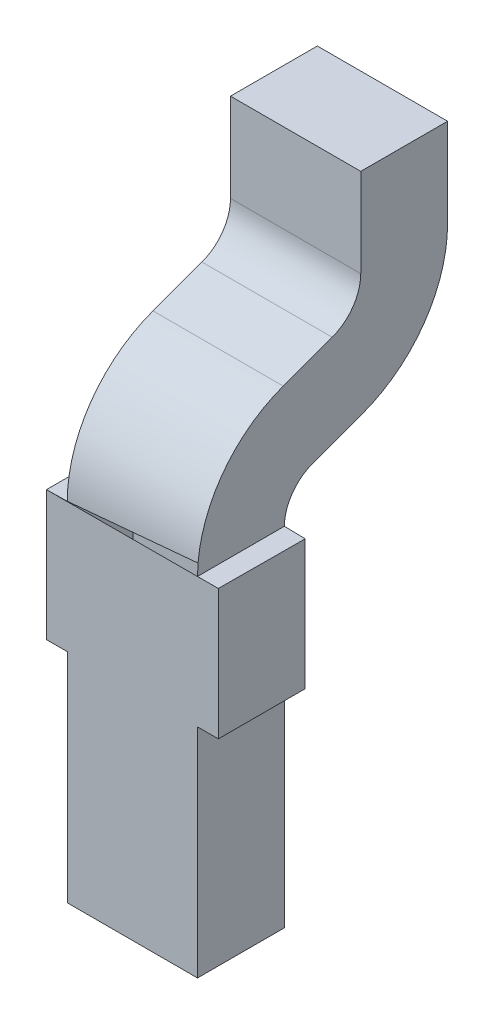
ISO-10303-21;
HEADER;
FILE_DESCRIPTION(('STEP AP214'),'2;1');
FILE_NAME('part.step','',(''),(''),'','','');
FILE_SCHEMA(('AUTOMOTIVE_DESIGN { 1 0 10303 214 1 1 1 1 }'));
ENDSEC;
DATA;
#1=APPLICATION_CONTEXT('core data for automotive mechanical design processes');
#2=APPLICATION_PROTOCOL_DEFINITION('international standard','automotive_design',2000,#1);
#3=PRODUCT_CONTEXT('',#1,'mechanical');
#4=PRODUCT('Part','Part','',(#3));
#5=PRODUCT_RELATED_PRODUCT_CATEGORY('part','',(#4));
#6=PRODUCT_DEFINITION_FORMATION('','',#4);
#7=PRODUCT_DEFINITION_CONTEXT('part definition',#1,'design');
#8=PRODUCT_DEFINITION('design','',#6,#7);
#9=PRODUCT_DEFINITION_SHAPE('','',#8);
#10=(LENGTH_UNIT() NAMED_UNIT(*) SI_UNIT(.MILLI.,.METRE.));
#11=(NAMED_UNIT(*) PLANE_ANGLE_UNIT() SI_UNIT($,.RADIAN.));
#12=(NAMED_UNIT(*) SI_UNIT($,.STERADIAN.) SOLID_ANGLE_UNIT());
#13=UNCERTAINTY_MEASURE_WITH_UNIT(LENGTH_MEASURE(1.E-05),#10,'distance_accuracy_value','');
#14=(GEOMETRIC_REPRESENTATION_CONTEXT(3) GLOBAL_UNCERTAINTY_ASSIGNED_CONTEXT((#13)) GLOBAL_UNIT_ASSIGNED_CONTEXT((#10,
#11,#12)) REPRESENTATION_CONTEXT('',''));
#15=CARTESIAN_POINT('',(0.,0.,0.));
#16=DIRECTION('',(0.,0.,1.));
#17=DIRECTION('',(1.,0.,0.));
#18=AXIS2_PLACEMENT_3D('',#15,#16,#17);
#19=CARTESIAN_POINT('',(135.749744279938,101.758469982888,143.086328634145));
#20=DIRECTION('',(1.,0.,0.));
#21=DIRECTION('',(0.,1.,0.));
#22=AXIS2_PLACEMENT_3D('',#19,#20,#21);
#23=PLANE('',#22);
#24=DIRECTION('',(0.,1.,0.));
#25=VECTOR('',#24,1.);
#26=CARTESIAN_POINT('',(135.749744279938,99.9047446285661,143.151470551509));
#27=LINE('',#26,#25);
#28=CARTESIAN_POINT('',(135.749744279938,99.9047446285661,143.151470551509));
#29=VERTEX_POINT('',#28);
#30=CARTESIAN_POINT('',(135.749744279938,101.15704329235,143.151470551509));
#31=VERTEX_POINT('',#30);
#32=EDGE_CURVE('E67',#29,#31,#27,.T.);
#33=ORIENTED_EDGE('',*,*,#32,.F.);
#34=DIRECTION('',(0.,0.,-1.));
#35=VECTOR('',#34,1.);
#36=CARTESIAN_POINT('',(135.749744279938,99.9047446285661,143.651470551509));
#37=LINE('',#36,#35);
#38=CARTESIAN_POINT('',(135.749744279938,99.9047446285661,143.651470551509));
#39=VERTEX_POINT('',#38);
#40=EDGE_CURVE('E233',#39,#29,#37,.T.);
#41=ORIENTED_EDGE('',*,*,#40,.F.);
#42=DIRECTION('',(0.,-1.,0.));
#43=VECTOR('',#42,1.);
#44=CARTESIAN_POINT('',(135.749744279938,101.904744628566,143.651470551509));
#45=LINE('',#44,#43);
#46=CARTESIAN_POINT('',(135.749744279938,101.15704329235,143.651470551509));
#47=VERTEX_POINT('',#46);
#48=EDGE_CURVE('E276',#47,#39,#45,.T.);
#49=ORIENTED_EDGE('',*,*,#48,.F.);
#50=DIRECTION('',(0.,0.,-1.));
#51=VECTOR('',#50,1.);
#52=CARTESIAN_POINT('',(135.749744279938,101.15704329235,142.648955771372));
#53=LINE('',#52,#51);
#54=EDGE_CURVE('E11',#47,#31,#53,.T.);
#55=ORIENTED_EDGE('',*,*,#54,.T.);
#56=EDGE_LOOP('',(#33,#41,#49,#55));
#57=FACE_BOUND('',#56,.T.);
#58=ADVANCED_FACE('F44',(#57),#23,.F.);
#59=CARTESIAN_POINT('',(137.094744279938,101.15704329235,142.211582908599));
#60=DIRECTION('',(0.,-1.,0.));
#61=DIRECTION('',(0.,0.,-1.));
#62=AXIS2_PLACEMENT_3D('',#59,#60,#61);
#63=PLANE('',#62);
#64=ORIENTED_EDGE('',*,*,#54,.F.);
#65=DIRECTION('',(1.,0.,0.));
#66=VECTOR('',#65,1.);
#67=CARTESIAN_POINT('',(136.857244279938,101.15704329235,143.651470551509));
#68=LINE('',#67,#66);
#69=CARTESIAN_POINT('',(135.629744279938,101.15704329235,143.651470551509));
#70=VERTEX_POINT('',#69);
#71=EDGE_CURVE('E247',#70,#47,#68,.T.);
#72=ORIENTED_EDGE('',*,*,#71,.F.);
#73=DIRECTION('',(0.,0.,-1.));
#74=VECTOR('',#73,1.);
#75=CARTESIAN_POINT('',(135.629744279938,101.15704329235,142.648955771372));
#76=LINE('',#75,#74);
#77=CARTESIAN_POINT('',(135.629744279938,101.15704329235,143.151470551509));
#78=VERTEX_POINT('',#77);
#79=EDGE_CURVE('E55',#70,#78,#76,.T.);
#80=ORIENTED_EDGE('',*,*,#79,.T.);
#81=DIRECTION('',(-1.,0.,0.));
#82=VECTOR('',#81,1.);
#83=CARTESIAN_POINT('',(136.857244279938,101.15704329235,143.151470551509));
#84=LINE('',#83,#82);
#85=EDGE_CURVE('E334',#31,#78,#84,.T.);
#86=ORIENTED_EDGE('',*,*,#85,.F.);
#87=EDGE_LOOP('',(#64,#72,#80,#86));
#88=FACE_BOUND('',#87,.T.);
#89=ADVANCED_FACE('F498',(#88),#63,.T.);
#90=CARTESIAN_POINT('',(135.629744279938,101.758469982888,143.086328634145));
#91=DIRECTION('',(1.,0.,0.));
#92=DIRECTION('',(0.,1.,0.));
#93=AXIS2_PLACEMENT_3D('',#90,#91,#92);
#94=PLANE('',#93);
#95=DIRECTION('',(0.,1.,0.));
#96=VECTOR('',#95,1.);
#97=CARTESIAN_POINT('',(135.629744279938,99.9047446285661,143.151470551509));
#98=LINE('',#97,#96);
#99=CARTESIAN_POINT('',(135.629744279938,101.904744628566,143.151470551509));
#100=VERTEX_POINT('',#99);
#101=EDGE_CURVE('E347',#78,#100,#98,.T.);
#102=ORIENTED_EDGE('',*,*,#101,.F.);
#103=ORIENTED_EDGE('',*,*,#79,.F.);
#104=DIRECTION('',(0.,-1.,0.));
#105=VECTOR('',#104,1.);
#106=CARTESIAN_POINT('',(135.629744279938,101.904744628566,143.651470551509));
#107=LINE('',#106,#105);
#108=CARTESIAN_POINT('',(135.629744279938,101.904744628566,143.651470551509));
#109=VERTEX_POINT('',#108);
#110=EDGE_CURVE('E369',#109,#70,#107,.T.);
#111=ORIENTED_EDGE('',*,*,#110,.F.);
#112=DIRECTION('',(0.,0.,1.));
#113=VECTOR('',#112,1.);
#114=CARTESIAN_POINT('',(135.629744279938,101.90704329235,142.648955771372));
#115=LINE('',#114,#113);
#116=EDGE_CURVE('E266',#100,#109,#115,.T.);
#117=ORIENTED_EDGE('',*,*,#116,.F.);
#118=EDGE_LOOP('',(#102,#103,#111,#117));
#119=FACE_BOUND('',#118,.T.);
#120=ADVANCED_FACE('F442',(#119),#94,.F.);
#121=CARTESIAN_POINT('',(130.594744279938,101.90704329235,142.211582908599));
#122=DIRECTION('',(0.,1.,0.));
#123=DIRECTION('',(1.,0.,0.));
#124=AXIS2_PLACEMENT_3D('',#121,#122,#123);
#125=PLANE('',#124);
#126=DIRECTION('',(0.,0.,1.));
#127=VECTOR('',#126,1.);
#128=CARTESIAN_POINT('',(135.749744279938,101.90704329235,142.648955771372));
#129=LINE('',#128,#127);
#130=CARTESIAN_POINT('',(135.749744279938,101.90704329235,143.151459983575));
#131=VERTEX_POINT('',#130);
#132=CARTESIAN_POINT('',(135.749744279938,101.90704329235,143.651467028931));
#133=VERTEX_POINT('',#132);
#134=EDGE_CURVE('E267',#131,#133,#129,.T.);
#135=ORIENTED_EDGE('',*,*,#134,.F.);
#136=DIRECTION('',(1.,0.,0.));
#137=VECTOR('',#136,1.);
#138=CARTESIAN_POINT('',(136.619744279938,101.90704329235,143.151459983575));
#139=LINE('',#138,#137);
#140=EDGE_CURVE('E365',#100,#131,#139,.T.);
#141=ORIENTED_EDGE('',*,*,#140,.F.);
#142=ORIENTED_EDGE('',*,*,#116,.T.);
#143=DIRECTION('',(1.,0.,0.));
#144=VECTOR('',#143,1.);
#145=CARTESIAN_POINT('',(136.619744279938,101.90704329235,143.651467028931));
#146=LINE('',#145,#144);
#147=EDGE_CURVE('E270',#109,#133,#146,.T.);
#148=ORIENTED_EDGE('',*,*,#147,.T.);
#149=EDGE_LOOP('',(#135,#141,#142,#148));
#150=FACE_BOUND('',#149,.T.);
#151=ADVANCED_FACE('F446',(#150),#125,.T.);
#152=CARTESIAN_POINT('',(135.749744279938,101.758469982888,143.086328634145));
#153=DIRECTION('',(1.,0.,0.));
#154=DIRECTION('',(0.,1.,0.));
#155=AXIS2_PLACEMENT_3D('',#152,#153,#154);
#156=PLANE('',#155);
#157=DIRECTION('',(0.,1.,0.));
#158=VECTOR('',#157,1.);
#159=CARTESIAN_POINT('',(135.749744279938,102.94704329235,142.211582908599));
#160=LINE('',#159,#158);
#161=CARTESIAN_POINT('',(135.749744279938,102.94704329235,142.211582908599));
#162=VERTEX_POINT('',#161);
#163=CARTESIAN_POINT('',(135.749744279938,103.45704329235,142.211582908599));
#164=VERTEX_POINT('',#163);
#165=EDGE_CURVE('E223',#162,#164,#160,.T.);
#166=ORIENTED_EDGE('',*,*,#165,.F.);
#167=CARTESIAN_POINT('',(135.749744279938,102.94704329235,142.961582908599));
#168=DIRECTION('',(1.,0.,0.));
#169=DIRECTION('',(0.,-0.939692620785816,-0.342020143325922));
#170=AXIS2_PLACEMENT_3D('',#167,#168,#169);
#171=CIRCLE('',#170,0.75);
#172=CARTESIAN_POINT('',(135.749744279938,102.242273826761,142.705067801105));
#173=VERTEX_POINT('',#172);
#174=EDGE_CURVE('E251',#173,#162,#171,.T.);
#175=ORIENTED_EDGE('',*,*,#174,.F.);
#176=DIRECTION('',(0.,0.342020143325932,-0.939692620785813));
#177=VECTOR('',#176,1.);
#178=CARTESIAN_POINT('',(135.749744279938,102.139667783763,142.986975587341));
#179=LINE('',#178,#177);
#180=CARTESIAN_POINT('',(135.749744279938,102.139667783763,142.986975587341));
#181=VERTEX_POINT('',#180);
#182=EDGE_CURVE('E274',#181,#173,#179,.T.);
#183=ORIENTED_EDGE('',*,*,#182,.F.);
#184=CARTESIAN_POINT('',(135.749744279938,101.904744628566,142.901470551509));
#185=DIRECTION('',(-1.,0.,0.));
#186=DIRECTION('',(0.,0.,1.));
#187=AXIS2_PLACEMENT_3D('',#184,#185,#186);
#188=CIRCLE('',#187,0.25);
#189=EDGE_CURVE('E362',#131,#181,#188,.T.);
#190=ORIENTED_EDGE('',*,*,#189,.F.);
#191=ORIENTED_EDGE('',*,*,#134,.T.);
#192=CARTESIAN_POINT('',(135.749744279938,101.904744628566,142.901470551509));
#193=DIRECTION('',(1.,0.,0.));
#194=DIRECTION('',(0.,0.939692620785816,0.342020143325922));
#195=AXIS2_PLACEMENT_3D('',#192,#193,#194);
#196=CIRCLE('',#195,0.75);
#197=CARTESIAN_POINT('',(135.749744279938,102.609514094156,143.157985659003));
#198=VERTEX_POINT('',#197);
#199=EDGE_CURVE('E323',#198,#133,#196,.T.);
#200=ORIENTED_EDGE('',*,*,#199,.F.);
#201=DIRECTION('',(0.,-0.342020143325932,0.939692620785813));
#202=VECTOR('',#201,1.);
#203=CARTESIAN_POINT('',(135.749744279938,102.712120137154,142.876077872768));
#204=LINE('',#203,#202);
#205=CARTESIAN_POINT('',(135.749744279938,102.712120137154,142.876077872768));
#206=VERTEX_POINT('',#205);
#207=EDGE_CURVE('E252',#206,#198,#204,.T.);
#208=ORIENTED_EDGE('',*,*,#207,.F.);
#209=CARTESIAN_POINT('',(135.749744279938,102.94704329235,142.961582908599));
#210=DIRECTION('',(-1.,0.,0.));
#211=DIRECTION('',(0.,0.,-1.));
#212=AXIS2_PLACEMENT_3D('',#209,#210,#211);
#213=CIRCLE('',#212,0.25);
#214=CARTESIAN_POINT('',(135.749744279938,102.94704329235,142.711582908599));
#215=VERTEX_POINT('',#214);
#216=EDGE_CURVE('E291',#215,#206,#213,.T.);
#217=ORIENTED_EDGE('',*,*,#216,.F.);
#218=DIRECTION('',(0.,-1.,0.));
#219=VECTOR('',#218,1.);
#220=CARTESIAN_POINT('',(135.749744279938,103.45704329235,142.711582908599));
#221=LINE('',#220,#219);
#222=CARTESIAN_POINT('',(135.749744279938,103.45704329235,142.711582908599));
#223=VERTEX_POINT('',#222);
#224=EDGE_CURVE('E296',#223,#215,#221,.T.);
#225=ORIENTED_EDGE('',*,*,#224,.F.);
#226=DIRECTION('',(0.,0.,1.));
#227=VECTOR('',#226,1.);
#228=CARTESIAN_POINT('',(135.749744279938,103.45704329235,142.211582908599));
#229=LINE('',#228,#227);
#230=EDGE_CURVE('E226',#164,#223,#229,.T.);
#231=ORIENTED_EDGE('',*,*,#230,.F.);
#232=EDGE_LOOP('',(#166,#175,#183,#190,#191,#200,#208,#217,#225,#231));
#233=FACE_BOUND('',#232,.T.);
#234=ADVANCED_FACE('F462',(#233),#156,.F.);
#235=CARTESIAN_POINT('',(136.499744279938,103.45704329235,142.711582908599));
#236=DIRECTION('',(0.,0.,1.));
#237=DIRECTION('',(1.,0.,0.));
#238=AXIS2_PLACEMENT_3D('',#235,#236,#237);
#239=PLANE('',#238);
#240=DIRECTION('',(-1.,0.,0.));
#241=VECTOR('',#240,1.);
#242=CARTESIAN_POINT('',(136.499744279938,103.45704329235,142.711582908599));
#243=LINE('',#242,#241);
#244=CARTESIAN_POINT('',(136.499744279938,103.45704329235,142.711582908599));
#245=VERTEX_POINT('',#244);
#246=EDGE_CURVE('E231',#245,#223,#243,.T.);
#247=ORIENTED_EDGE('',*,*,#246,.T.);
#248=ORIENTED_EDGE('',*,*,#224,.T.);
#249=DIRECTION('',(-1.,0.,0.));
#250=VECTOR('',#249,1.);
#251=CARTESIAN_POINT('',(136.499744279938,102.94704329235,142.711582908599));
#252=LINE('',#251,#250);
#253=CARTESIAN_POINT('',(136.499744279938,102.94704329235,142.711582908599));
#254=VERTEX_POINT('',#253);
#255=EDGE_CURVE('E292',#254,#215,#252,.T.);
#256=ORIENTED_EDGE('',*,*,#255,.F.);
#257=DIRECTION('',(0.,-1.,0.));
#258=VECTOR('',#257,1.);
#259=CARTESIAN_POINT('',(136.499744279938,103.45704329235,142.711582908599));
#260=LINE('',#259,#258);
#261=EDGE_CURVE('E234',#245,#254,#260,.T.);
#262=ORIENTED_EDGE('',*,*,#261,.F.);
#263=EDGE_LOOP('',(#247,#248,#256,#262));
#264=FACE_BOUND('',#263,.T.);
#265=ADVANCED_FACE('F470',(#264),#239,.T.);
#266=CARTESIAN_POINT('',(136.499744279938,102.94704329235,142.961582908599));
#267=DIRECTION('',(1.,0.,0.));
#268=DIRECTION('',(0.,0.,-1.));
#269=AXIS2_PLACEMENT_3D('',#266,#267,#268);
#270=CYLINDRICAL_SURFACE('',#269,0.25);
#271=ORIENTED_EDGE('',*,*,#255,.T.);
#272=ORIENTED_EDGE('',*,*,#216,.T.);
#273=DIRECTION('',(-1.,0.,0.));
#274=VECTOR('',#273,1.);
#275=CARTESIAN_POINT('',(136.499744279938,102.712120137154,142.876077872768));
#276=LINE('',#275,#274);
#277=CARTESIAN_POINT('',(136.499744279938,102.712120137154,142.876077872768));
#278=VERTEX_POINT('',#277);
#279=EDGE_CURVE('E256',#278,#206,#276,.T.);
#280=ORIENTED_EDGE('',*,*,#279,.F.);
#281=CARTESIAN_POINT('',(136.499744279938,102.94704329235,142.961582908599));
#282=DIRECTION('',(-1.,0.,0.));
#283=DIRECTION('',(0.,0.,-1.));
#284=AXIS2_PLACEMENT_3D('',#281,#282,#283);
#285=CIRCLE('',#284,0.25);
#286=EDGE_CURVE('E243',#254,#278,#285,.T.);
#287=ORIENTED_EDGE('',*,*,#286,.F.);
#288=EDGE_LOOP('',(#271,#272,#280,#287));
#289=FACE_BOUND('',#288,.T.);
#290=ADVANCED_FACE('F466',(#289),#270,.F.);
#291=CARTESIAN_POINT('',(136.499744279938,102.712120137154,142.876077872768));
#292=DIRECTION('',(0.,0.939692620785813,0.342020143325932));
#293=DIRECTION('',(1.,0.,0.));
#294=AXIS2_PLACEMENT_3D('',#291,#292,#293);
#295=PLANE('',#294);
#296=ORIENTED_EDGE('',*,*,#279,.T.);
#297=ORIENTED_EDGE('',*,*,#207,.T.);
#298=DIRECTION('',(-1.,0.,0.));
#299=VECTOR('',#298,1.);
#300=CARTESIAN_POINT('',(136.499744279938,102.609514094156,143.157985659003));
#301=LINE('',#300,#299);
#302=CARTESIAN_POINT('',(136.499744279938,102.609514094156,143.157985659003));
#303=VERTEX_POINT('',#302);
#304=EDGE_CURVE('E318',#303,#198,#301,.T.);
#305=ORIENTED_EDGE('',*,*,#304,.F.);
#306=DIRECTION('',(0.,-0.342020143325932,0.939692620785813));
#307=VECTOR('',#306,1.);
#308=CARTESIAN_POINT('',(136.499744279938,102.712120137154,142.876077872768));
#309=LINE('',#308,#307);
#310=EDGE_CURVE('E258',#278,#303,#309,.T.);
#311=ORIENTED_EDGE('',*,*,#310,.F.);
#312=EDGE_LOOP('',(#296,#297,#305,#311));
#313=FACE_BOUND('',#312,.T.);
#314=ADVANCED_FACE('F459',(#313),#295,.T.);
#315=CARTESIAN_POINT('',(136.499744279938,102.139667783763,142.986975587341));
#316=DIRECTION('',(0.,-0.939692620785813,-0.342020143325932));
#317=DIRECTION('',(0.,0.342020143325932,-0.939692620785813));
#318=AXIS2_PLACEMENT_3D('',#315,#316,#317);
#319=PLANE('',#318);
#320=DIRECTION('',(-1.,0.,0.));
#321=VECTOR('',#320,1.);
#322=CARTESIAN_POINT('',(136.499744279938,102.139667783763,142.986975587341));
#323=LINE('',#322,#321);
#324=CARTESIAN_POINT('',(136.499744279938,102.139667783763,142.986975587341));
#325=VERTEX_POINT('',#324);
#326=EDGE_CURVE('E257',#325,#181,#323,.T.);
#327=ORIENTED_EDGE('',*,*,#326,.T.);
#328=ORIENTED_EDGE('',*,*,#182,.T.);
#329=DIRECTION('',(-1.,0.,0.));
#330=VECTOR('',#329,1.);
#331=CARTESIAN_POINT('',(136.499744279938,102.242273826761,142.705067801105));
#332=LINE('',#331,#330);
#333=CARTESIAN_POINT('',(136.499744279938,102.242273826761,142.705067801105));
#334=VERTEX_POINT('',#333);
#335=EDGE_CURVE('E271',#334,#173,#332,.T.);
#336=ORIENTED_EDGE('',*,*,#335,.F.);
#337=DIRECTION('',(0.,0.342020143325932,-0.939692620785813));
#338=VECTOR('',#337,1.);
#339=CARTESIAN_POINT('',(136.499744279938,102.139667783763,142.986975587341));
#340=LINE('',#339,#338);
#341=EDGE_CURVE('E284',#325,#334,#340,.T.);
#342=ORIENTED_EDGE('',*,*,#341,.F.);
#343=EDGE_LOOP('',(#327,#328,#336,#342));
#344=FACE_BOUND('',#343,.T.);
#345=ADVANCED_FACE('F515',(#344),#319,.T.);
#346=CARTESIAN_POINT('',(136.499744279938,102.94704329235,142.961582908599));
#347=DIRECTION('',(1.,0.,0.));
#348=DIRECTION('',(0.,-0.939692620785816,-0.342020143325922));
#349=AXIS2_PLACEMENT_3D('',#346,#347,#348);
#350=CYLINDRICAL_SURFACE('',#349,0.75);
#351=ORIENTED_EDGE('',*,*,#335,.T.);
#352=ORIENTED_EDGE('',*,*,#174,.T.);
#353=DIRECTION('',(-1.,0.,0.));
#354=VECTOR('',#353,1.);
#355=CARTESIAN_POINT('',(136.499744279938,102.94704329235,142.211582908599));
#356=LINE('',#355,#354);
#357=CARTESIAN_POINT('',(136.499744279938,102.94704329235,142.211582908599));
#358=VERTEX_POINT('',#357);
#359=EDGE_CURVE('E249',#358,#162,#356,.T.);
#360=ORIENTED_EDGE('',*,*,#359,.F.);
#361=CARTESIAN_POINT('',(136.499744279938,102.94704329235,142.961582908599));
#362=DIRECTION('',(1.,0.,0.));
#363=DIRECTION('',(0.,-0.939692620785816,-0.342020143325922));
#364=AXIS2_PLACEMENT_3D('',#361,#362,#363);
#365=CIRCLE('',#364,0.75);
#366=EDGE_CURVE('E202',#334,#358,#365,.T.);
#367=ORIENTED_EDGE('',*,*,#366,.F.);
#368=EDGE_LOOP('',(#351,#352,#360,#367));
#369=FACE_BOUND('',#368,.T.);
#370=ADVANCED_FACE('F530',(#369),#350,.T.);
#371=CARTESIAN_POINT('',(136.499744279938,102.94704329235,142.211582908599));
#372=DIRECTION('',(0.,0.,-1.));
#373=DIRECTION('',(0.,-1.,0.));
#374=AXIS2_PLACEMENT_3D('',#371,#372,#373);
#375=PLANE('',#374);
#376=ORIENTED_EDGE('',*,*,#359,.T.);
#377=ORIENTED_EDGE('',*,*,#165,.T.);
#378=DIRECTION('',(-1.,0.,0.));
#379=VECTOR('',#378,1.);
#380=CARTESIAN_POINT('',(136.499744279938,103.45704329235,142.211582908599));
#381=LINE('',#380,#379);
#382=CARTESIAN_POINT('',(136.499744279938,103.45704329235,142.211582908599));
#383=VERTEX_POINT('',#382);
#384=EDGE_CURVE('E221',#383,#164,#381,.T.);
#385=ORIENTED_EDGE('',*,*,#384,.F.);
#386=DIRECTION('',(0.,1.,0.));
#387=VECTOR('',#386,1.);
#388=CARTESIAN_POINT('',(136.499744279938,102.94704329235,142.211582908599));
#389=LINE('',#388,#387);
#390=EDGE_CURVE('E209',#358,#383,#389,.T.);
#391=ORIENTED_EDGE('',*,*,#390,.F.);
#392=EDGE_LOOP('',(#376,#377,#385,#391));
#393=FACE_BOUND('',#392,.T.);
#394=ADVANCED_FACE('F222',(#393),#375,.T.);
#395=CARTESIAN_POINT('',(136.499744279938,103.45704329235,142.211582908599));
#396=DIRECTION('',(0.,1.,0.));
#397=DIRECTION('',(1.,0.,0.));
#398=AXIS2_PLACEMENT_3D('',#395,#396,#397);
#399=PLANE('',#398);
#400=ORIENTED_EDGE('',*,*,#384,.T.);
#401=ORIENTED_EDGE('',*,*,#230,.T.);
#402=ORIENTED_EDGE('',*,*,#246,.F.);
#403=DIRECTION('',(0.,0.,1.));
#404=VECTOR('',#403,1.);
#405=CARTESIAN_POINT('',(136.499744279938,103.45704329235,142.211582908599));
#406=LINE('',#405,#404);
#407=EDGE_CURVE('E213',#383,#245,#406,.T.);
#408=ORIENTED_EDGE('',*,*,#407,.F.);
#409=EDGE_LOOP('',(#400,#401,#402,#408));
#410=FACE_BOUND('',#409,.T.);
#411=ADVANCED_FACE('F229',(#410),#399,.T.);
#412=CARTESIAN_POINT('',(136.499744279938,99.9047446285661,143.651470551509));
#413=DIRECTION('',(0.,-1.,0.));
#414=DIRECTION('',(0.,0.,-1.));
#415=AXIS2_PLACEMENT_3D('',#412,#413,#414);
#416=PLANE('',#415);
#417=DIRECTION('',(-1.,0.,0.));
#418=VECTOR('',#417,1.);
#419=CARTESIAN_POINT('',(136.499744279938,99.9047446285661,143.651470551509));
#420=LINE('',#419,#418);
#421=CARTESIAN_POINT('',(136.499744279938,99.9047446285661,143.651470551509));
#422=VERTEX_POINT('',#421);
#423=EDGE_CURVE('E240',#422,#39,#420,.T.);
#424=ORIENTED_EDGE('',*,*,#423,.T.);
#425=ORIENTED_EDGE('',*,*,#40,.T.);
#426=DIRECTION('',(-1.,0.,0.));
#427=VECTOR('',#426,1.);
#428=CARTESIAN_POINT('',(136.499744279938,99.9047446285661,143.151470551509));
#429=LINE('',#428,#427);
#430=CARTESIAN_POINT('',(136.499744279938,99.9047446285661,143.151470551509));
#431=VERTEX_POINT('',#430);
#432=EDGE_CURVE('E314',#431,#29,#429,.T.);
#433=ORIENTED_EDGE('',*,*,#432,.F.);
#434=DIRECTION('',(0.,0.,-1.));
#435=VECTOR('',#434,1.);
#436=CARTESIAN_POINT('',(136.499744279938,99.9047446285661,143.651470551509));
#437=LINE('',#436,#435);
#438=EDGE_CURVE('E297',#422,#431,#437,.T.);
#439=ORIENTED_EDGE('',*,*,#438,.F.);
#440=EDGE_LOOP('',(#424,#425,#433,#439));
#441=FACE_BOUND('',#440,.T.);
#442=ADVANCED_FACE('F495',(#441),#416,.T.);
#443=CARTESIAN_POINT('',(136.499744279938,101.758469982888,143.086328634145));
#444=DIRECTION('',(1.,0.,0.));
#445=DIRECTION('',(0.,1.,0.));
#446=AXIS2_PLACEMENT_3D('',#443,#444,#445);
#447=PLANE('',#446);
#448=ORIENTED_EDGE('',*,*,#407,.T.);
#449=ORIENTED_EDGE('',*,*,#261,.T.);
#450=ORIENTED_EDGE('',*,*,#286,.T.);
#451=ORIENTED_EDGE('',*,*,#310,.T.);
#452=CARTESIAN_POINT('',(136.499744279938,101.904744628566,142.901470551509));
#453=DIRECTION('',(1.,0.,0.));
#454=DIRECTION('',(0.,0.939692620785816,0.342020143325922));
#455=AXIS2_PLACEMENT_3D('',#452,#453,#454);
#456=CIRCLE('',#455,0.75);
#457=CARTESIAN_POINT('',(136.499744279938,101.90704329235,143.651467028931));
#458=VERTEX_POINT('',#457);
#459=EDGE_CURVE('E262',#303,#458,#456,.T.);
#460=ORIENTED_EDGE('',*,*,#459,.T.);
#461=DIRECTION('',(0.,0.,1.));
#462=VECTOR('',#461,1.);
#463=CARTESIAN_POINT('',(136.499744279938,101.90704329235,142.648955771372));
#464=LINE('',#463,#462);
#465=CARTESIAN_POINT('',(136.499744279938,101.90704329235,143.151459983575));
#466=VERTEX_POINT('',#465);
#467=EDGE_CURVE('E344',#466,#458,#464,.T.);
#468=ORIENTED_EDGE('',*,*,#467,.F.);
#469=CARTESIAN_POINT('',(136.499744279938,101.904744628566,142.901470551509));
#470=DIRECTION('',(-1.,0.,0.));
#471=DIRECTION('',(0.,0.,1.));
#472=AXIS2_PLACEMENT_3D('',#469,#470,#471);
#473=CIRCLE('',#472,0.25);
#474=EDGE_CURVE('E280',#466,#325,#473,.T.);
#475=ORIENTED_EDGE('',*,*,#474,.T.);
#476=ORIENTED_EDGE('',*,*,#341,.T.);
#477=ORIENTED_EDGE('',*,*,#366,.T.);
#478=ORIENTED_EDGE('',*,*,#390,.T.);
#479=EDGE_LOOP('',(#448,#449,#450,#451,#460,#468,#475,#476,#477,#478));
#480=FACE_BOUND('',#479,.T.);
#481=ADVANCED_FACE('F211',(#480),#447,.T.);
#482=CARTESIAN_POINT('',(136.499744279938,101.758469982888,143.086328634145));
#483=DIRECTION('',(1.,0.,0.));
#484=DIRECTION('',(0.,1.,0.));
#485=AXIS2_PLACEMENT_3D('',#482,#483,#484);
#486=PLANE('',#485);
#487=DIRECTION('',(0.,0.,-1.));
#488=VECTOR('',#487,1.);
#489=CARTESIAN_POINT('',(136.499744279938,101.15704329235,142.648955771372));
#490=LINE('',#489,#488);
#491=CARTESIAN_POINT('',(136.499744279938,101.15704329235,143.651470551509));
#492=VERTEX_POINT('',#491);
#493=CARTESIAN_POINT('',(136.499744279938,101.15704329235,143.151470551509));
#494=VERTEX_POINT('',#493);
#495=EDGE_CURVE('E310',#492,#494,#490,.T.);
#496=ORIENTED_EDGE('',*,*,#495,.F.);
#497=DIRECTION('',(0.,-1.,0.));
#498=VECTOR('',#497,1.);
#499=CARTESIAN_POINT('',(136.499744279938,101.904744628566,143.651470551509));
#500=LINE('',#499,#498);
#501=EDGE_CURVE('E217',#492,#422,#500,.T.);
#502=ORIENTED_EDGE('',*,*,#501,.T.);
#503=ORIENTED_EDGE('',*,*,#438,.T.);
#504=DIRECTION('',(0.,1.,0.));
#505=VECTOR('',#504,1.);
#506=CARTESIAN_POINT('',(136.499744279938,99.9047446285661,143.151470551509));
#507=LINE('',#506,#505);
#508=EDGE_CURVE('E301',#431,#494,#507,.T.);
#509=ORIENTED_EDGE('',*,*,#508,.T.);
#510=EDGE_LOOP('',(#496,#502,#503,#509));
#511=FACE_BOUND('',#510,.T.);
#512=ADVANCED_FACE('F492',(#511),#486,.T.);
#513=CARTESIAN_POINT('',(130.594744279938,101.90704329235,142.211582908599));
#514=DIRECTION('',(0.,1.,0.));
#515=DIRECTION('',(1.,0.,0.));
#516=AXIS2_PLACEMENT_3D('',#513,#514,#515);
#517=PLANE('',#516);
#518=DIRECTION('',(0.,0.,1.));
#519=VECTOR('',#518,1.);
#520=CARTESIAN_POINT('',(136.619744279938,101.90704329235,142.648955771372));
#521=LINE('',#520,#519);
#522=CARTESIAN_POINT('',(136.619744279938,101.904744628566,143.151470551509));
#523=VERTEX_POINT('',#522);
#524=CARTESIAN_POINT('',(136.619744279938,101.90704329235,143.651467028931));
#525=VERTEX_POINT('',#524);
#526=EDGE_CURVE('E405',#523,#525,#521,.T.);
#527=ORIENTED_EDGE('',*,*,#526,.F.);
#528=DIRECTION('',(1.,0.,0.));
#529=VECTOR('',#528,1.);
#530=CARTESIAN_POINT('',(136.619744279938,101.90704329235,143.151459983575));
#531=LINE('',#530,#529);
#532=EDGE_CURVE('E366',#466,#523,#531,.T.);
#533=ORIENTED_EDGE('',*,*,#532,.F.);
#534=ORIENTED_EDGE('',*,*,#467,.T.);
#535=DIRECTION('',(1.,0.,0.));
#536=VECTOR('',#535,1.);
#537=CARTESIAN_POINT('',(136.619744279938,101.90704329235,143.651467028931));
#538=LINE('',#537,#536);
#539=EDGE_CURVE('E322',#458,#525,#538,.T.);
#540=ORIENTED_EDGE('',*,*,#539,.T.);
#541=EDGE_LOOP('',(#527,#533,#534,#540));
#542=FACE_BOUND('',#541,.T.);
#543=ADVANCED_FACE('F456',(#542),#517,.T.);
#544=CARTESIAN_POINT('',(136.619744279938,101.904744628566,142.901470551509));
#545=DIRECTION('',(1.,0.,0.));
#546=DIRECTION('',(0.,0.939692620785816,0.342020143325922));
#547=AXIS2_PLACEMENT_3D('',#544,#545,#546);
#548=CYLINDRICAL_SURFACE('',#547,0.75);
#549=DIRECTION('',(-1.,0.,0.));
#550=VECTOR('',#549,1.);
#551=CARTESIAN_POINT('',(136.619744279938,101.904744628566,143.651470551509));
#552=LINE('',#551,#550);
#553=EDGE_CURVE('E355',#525,#109,#552,.T.);
#554=ORIENTED_EDGE('',*,*,#553,.F.);
#555=ORIENTED_EDGE('',*,*,#539,.F.);
#556=ORIENTED_EDGE('',*,*,#459,.F.);
#557=ORIENTED_EDGE('',*,*,#304,.T.);
#558=ORIENTED_EDGE('',*,*,#199,.T.);
#559=ORIENTED_EDGE('',*,*,#147,.F.);
#560=EDGE_LOOP('',(#554,#555,#556,#557,#558,#559));
#561=FACE_BOUND('',#560,.T.);
#562=ADVANCED_FACE('F454',(#561),#548,.T.);
#563=CARTESIAN_POINT('',(136.619744279938,101.904744628566,143.651470551509));
#564=DIRECTION('',(0.,0.,1.));
#565=DIRECTION('',(1.,0.,0.));
#566=AXIS2_PLACEMENT_3D('',#563,#564,#565);
#567=PLANE('',#566);
#568=DIRECTION('',(0.,-1.,0.));
#569=VECTOR('',#568,1.);
#570=CARTESIAN_POINT('',(136.619744279938,101.904744628566,143.651470551509));
#571=LINE('',#570,#569);
#572=CARTESIAN_POINT('',(136.619744279938,101.15704329235,143.651470551509));
#573=VERTEX_POINT('',#572);
#574=EDGE_CURVE('E308',#525,#573,#571,.T.);
#575=ORIENTED_EDGE('',*,*,#574,.F.);
#576=ORIENTED_EDGE('',*,*,#553,.T.);
#577=ORIENTED_EDGE('',*,*,#110,.T.);
#578=ORIENTED_EDGE('',*,*,#71,.T.);
#579=ORIENTED_EDGE('',*,*,#48,.T.);
#580=ORIENTED_EDGE('',*,*,#423,.F.);
#581=ORIENTED_EDGE('',*,*,#501,.F.);
#582=DIRECTION('',(1.,0.,0.));
#583=VECTOR('',#582,1.);
#584=CARTESIAN_POINT('',(136.857244279938,101.15704329235,143.651470551509));
#585=LINE('',#584,#583);
#586=EDGE_CURVE('E279',#492,#573,#585,.T.);
#587=ORIENTED_EDGE('',*,*,#586,.T.);
#588=EDGE_LOOP('',(#575,#576,#577,#578,#579,#580,#581,#587));
#589=FACE_BOUND('',#588,.T.);
#590=ADVANCED_FACE('F450',(#589),#567,.T.);
#591=CARTESIAN_POINT('',(137.094744279938,101.15704329235,142.211582908599));
#592=DIRECTION('',(0.,-1.,0.));
#593=DIRECTION('',(0.,0.,-1.));
#594=AXIS2_PLACEMENT_3D('',#591,#592,#593);
#595=PLANE('',#594);
#596=DIRECTION('',(0.,0.,-1.));
#597=VECTOR('',#596,1.);
#598=CARTESIAN_POINT('',(136.619744279938,101.15704329235,142.648955771372));
#599=LINE('',#598,#597);
#600=CARTESIAN_POINT('',(136.619744279938,101.15704329235,143.151470551509));
#601=VERTEX_POINT('',#600);
#602=EDGE_CURVE('E305',#573,#601,#599,.T.);
#603=ORIENTED_EDGE('',*,*,#602,.F.);
#604=ORIENTED_EDGE('',*,*,#586,.F.);
#605=ORIENTED_EDGE('',*,*,#495,.T.);
#606=DIRECTION('',(-1.,0.,0.));
#607=VECTOR('',#606,1.);
#608=CARTESIAN_POINT('',(136.857244279938,101.15704329235,143.151470551509));
#609=LINE('',#608,#607);
#610=EDGE_CURVE('E313',#601,#494,#609,.T.);
#611=ORIENTED_EDGE('',*,*,#610,.F.);
#612=EDGE_LOOP('',(#603,#604,#605,#611));
#613=FACE_BOUND('',#612,.T.);
#614=ADVANCED_FACE('F488',(#613),#595,.T.);
#615=CARTESIAN_POINT('',(136.619744279938,99.9047446285661,143.151470551509));
#616=DIRECTION('',(0.,0.,-1.));
#617=DIRECTION('',(-1.,0.,0.));
#618=AXIS2_PLACEMENT_3D('',#615,#616,#617);
#619=PLANE('',#618);
#620=DIRECTION('',(0.,1.,0.));
#621=VECTOR('',#620,1.);
#622=CARTESIAN_POINT('',(136.619744279938,99.9047446285661,143.151470551509));
#623=LINE('',#622,#621);
#624=EDGE_CURVE('E309',#601,#523,#623,.T.);
#625=ORIENTED_EDGE('',*,*,#624,.F.);
#626=ORIENTED_EDGE('',*,*,#610,.T.);
#627=ORIENTED_EDGE('',*,*,#508,.F.);
#628=ORIENTED_EDGE('',*,*,#432,.T.);
#629=ORIENTED_EDGE('',*,*,#32,.T.);
#630=ORIENTED_EDGE('',*,*,#85,.T.);
#631=ORIENTED_EDGE('',*,*,#101,.T.);
#632=DIRECTION('',(-1.,0.,0.));
#633=VECTOR('',#632,1.);
#634=CARTESIAN_POINT('',(136.619744279938,101.904744628566,143.151470551509));
#635=LINE('',#634,#633);
#636=EDGE_CURVE('E392',#523,#100,#635,.T.);
#637=ORIENTED_EDGE('',*,*,#636,.F.);
#638=EDGE_LOOP('',(#625,#626,#627,#628,#629,#630,#631,#637));
#639=FACE_BOUND('',#638,.T.);
#640=ADVANCED_FACE('F435',(#639),#619,.T.);
#641=CARTESIAN_POINT('',(136.619744279938,101.904744628566,142.901470551509));
#642=DIRECTION('',(1.,0.,0.));
#643=DIRECTION('',(0.,0.,1.));
#644=AXIS2_PLACEMENT_3D('',#641,#642,#643);
#645=CYLINDRICAL_SURFACE('',#644,0.25);
#646=ORIENTED_EDGE('',*,*,#636,.T.);
#647=ORIENTED_EDGE('',*,*,#140,.T.);
#648=ORIENTED_EDGE('',*,*,#189,.T.);
#649=ORIENTED_EDGE('',*,*,#326,.F.);
#650=ORIENTED_EDGE('',*,*,#474,.F.);
#651=ORIENTED_EDGE('',*,*,#532,.T.);
#652=EDGE_LOOP('',(#646,#647,#648,#649,#650,#651));
#653=FACE_BOUND('',#652,.T.);
#654=ADVANCED_FACE('F429',(#653),#645,.F.);
#655=CARTESIAN_POINT('',(136.619744279938,101.758469982888,143.086328634145));
#656=DIRECTION('',(1.,0.,0.));
#657=DIRECTION('',(0.,1.,0.));
#658=AXIS2_PLACEMENT_3D('',#655,#656,#657);
#659=PLANE('',#658);
#660=ORIENTED_EDGE('',*,*,#526,.T.);
#661=ORIENTED_EDGE('',*,*,#574,.T.);
#662=ORIENTED_EDGE('',*,*,#602,.T.);
#663=ORIENTED_EDGE('',*,*,#624,.T.);
#664=EDGE_LOOP('',(#660,#661,#662,#663));
#665=FACE_BOUND('',#664,.T.);
#666=ADVANCED_FACE('F46',(#665),#659,.T.);
#667=CLOSED_SHELL('',(#58,#89,#120,#151,#234,#265,#290,#314,#345,#370,#394,#411,#442,#481,#512,
#543,#562,#590,#614,#640,#654,#666));
#668=MANIFOLD_SOLID_BREP('B2',#667);
#669=ADVANCED_BREP_SHAPE_REPRESENTATION('',(#18,#668),#14);
#670=SHAPE_DEFINITION_REPRESENTATION(#9,#669);
ENDSEC;
END-ISO-10303-21;
